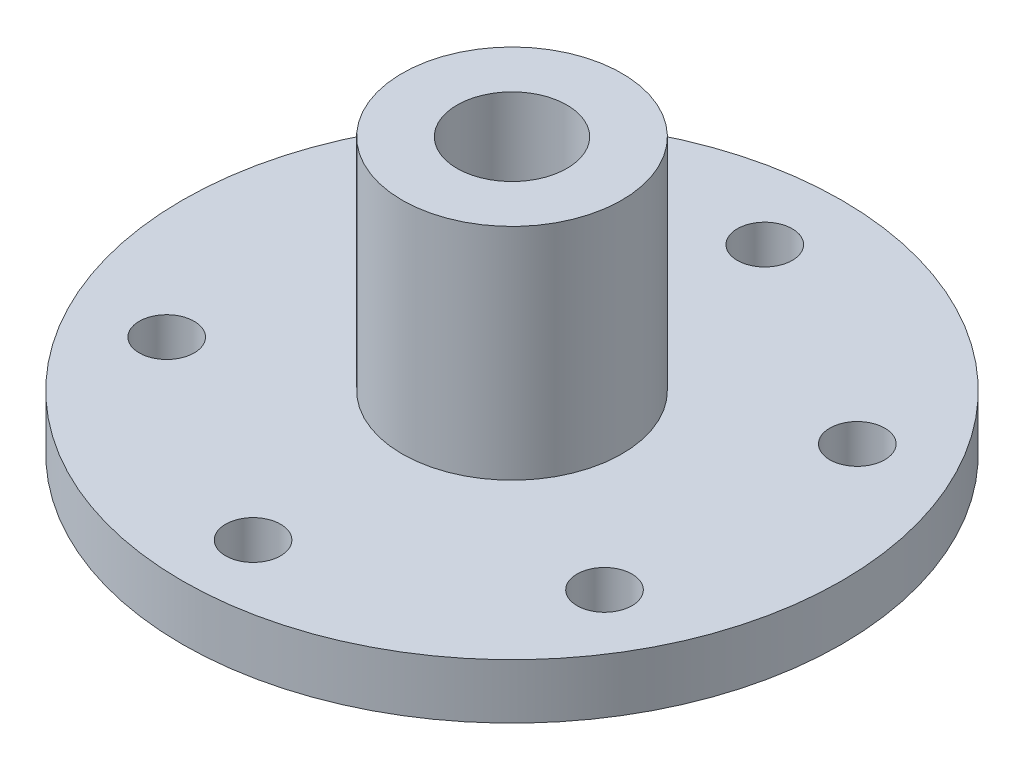
ISO-10303-21;
HEADER;
FILE_DESCRIPTION(('STEP AP214'),'2;1');
FILE_NAME('part.step','',(''),(''),'','','');
FILE_SCHEMA(('AUTOMOTIVE_DESIGN { 1 0 10303 214 1 1 1 1 }'));
ENDSEC;
DATA;
#1=APPLICATION_CONTEXT('core data for automotive mechanical design processes');
#2=APPLICATION_PROTOCOL_DEFINITION('international standard','automotive_design',2000,#1);
#3=PRODUCT_CONTEXT('',#1,'mechanical');
#4=PRODUCT('Part','Part','',(#3));
#5=PRODUCT_RELATED_PRODUCT_CATEGORY('part','',(#4));
#6=PRODUCT_DEFINITION_FORMATION('','',#4);
#7=PRODUCT_DEFINITION_CONTEXT('part definition',#1,'design');
#8=PRODUCT_DEFINITION('design','',#6,#7);
#9=PRODUCT_DEFINITION_SHAPE('','',#8);
#10=(LENGTH_UNIT() NAMED_UNIT(*) SI_UNIT(.MILLI.,.METRE.));
#11=(NAMED_UNIT(*) PLANE_ANGLE_UNIT() SI_UNIT($,.RADIAN.));
#12=(NAMED_UNIT(*) SI_UNIT($,.STERADIAN.) SOLID_ANGLE_UNIT());
#13=UNCERTAINTY_MEASURE_WITH_UNIT(LENGTH_MEASURE(1.E-05),#10,'distance_accuracy_value','');
#14=(GEOMETRIC_REPRESENTATION_CONTEXT(3) GLOBAL_UNCERTAINTY_ASSIGNED_CONTEXT((#13)) GLOBAL_UNIT_ASSIGNED_CONTEXT((#10,
#11,#12)) REPRESENTATION_CONTEXT('',''));
#15=CARTESIAN_POINT('',(0.,0.,0.));
#16=DIRECTION('',(0.,0.,1.));
#17=DIRECTION('',(1.,0.,0.));
#18=AXIS2_PLACEMENT_3D('',#15,#16,#17);
#19=CARTESIAN_POINT('',(0.,5.,0.));
#20=DIRECTION('',(0.,1.,0.));
#21=DIRECTION('',(0.,0.,1.));
#22=AXIS2_PLACEMENT_3D('',#19,#20,#21);
#23=PLANE('',#22);
#24=CARTESIAN_POINT('',(0.,5.,0.));
#25=DIRECTION('',(0.,1.,0.));
#26=DIRECTION('',(0.,0.,1.));
#27=AXIS2_PLACEMENT_3D('',#24,#25,#26);
#28=CIRCLE('',#27,10.);
#29=CARTESIAN_POINT('',(0.,5.,10.));
#30=VERTEX_POINT('',#29);
#31=EDGE_CURVE('E80',#30,#30,#28,.T.);
#32=ORIENTED_EDGE('',*,*,#31,.F.);
#33=EDGE_LOOP('',(#32));
#34=FACE_BOUND('',#33,.T.);
#35=CARTESIAN_POINT('',(-19.9185842870422,5.,11.4999999999998));
#36=DIRECTION('',(0.,1.,0.));
#37=DIRECTION('',(0.,0.,1.));
#38=AXIS2_PLACEMENT_3D('',#35,#36,#37);
#39=CIRCLE('',#38,2.5);
#40=CARTESIAN_POINT('',(-19.9185842870422,5.,13.9999999999998));
#41=VERTEX_POINT('',#40);
#42=EDGE_CURVE('E65',#41,#41,#39,.T.);
#43=ORIENTED_EDGE('',*,*,#42,.F.);
#44=EDGE_LOOP('',(#43));
#45=FACE_BOUND('',#44,.T.);
#46=CARTESIAN_POINT('',(19.918584287042,5.,11.5000000000001));
#47=DIRECTION('',(0.,1.,0.));
#48=DIRECTION('',(0.,0.,1.));
#49=AXIS2_PLACEMENT_3D('',#46,#47,#48);
#50=CIRCLE('',#49,2.5);
#51=CARTESIAN_POINT('',(19.918584287042,5.,14.0000000000001));
#52=VERTEX_POINT('',#51);
#53=EDGE_CURVE('E53',#52,#52,#50,.T.);
#54=ORIENTED_EDGE('',*,*,#53,.F.);
#55=EDGE_LOOP('',(#54));
#56=FACE_BOUND('',#55,.T.);
#57=CARTESIAN_POINT('',(0.,5.,-23.));
#58=DIRECTION('',(0.,1.,0.));
#59=DIRECTION('',(0.,0.,1.));
#60=AXIS2_PLACEMENT_3D('',#57,#58,#59);
#61=CIRCLE('',#60,2.5);
#62=CARTESIAN_POINT('',(0.,5.,-20.5));
#63=VERTEX_POINT('',#62);
#64=EDGE_CURVE('E42',#63,#63,#61,.T.);
#65=ORIENTED_EDGE('',*,*,#64,.F.);
#66=EDGE_LOOP('',(#65));
#67=FACE_BOUND('',#66,.T.);
#68=CARTESIAN_POINT('',(0.,5.,0.));
#69=DIRECTION('',(0.,1.,0.));
#70=DIRECTION('',(0.,0.,1.));
#71=AXIS2_PLACEMENT_3D('',#68,#69,#70);
#72=CIRCLE('',#71,30.);
#73=CARTESIAN_POINT('',(0.,5.,30.));
#74=VERTEX_POINT('',#73);
#75=EDGE_CURVE('E10',#74,#74,#72,.T.);
#76=ORIENTED_EDGE('',*,*,#75,.T.);
#77=EDGE_LOOP('',(#76));
#78=FACE_BOUND('',#77,.T.);
#79=CARTESIAN_POINT('',(19.9185842870421,5.,-11.5));
#80=DIRECTION('',(0.,1.,0.));
#81=DIRECTION('',(0.,0.,1.));
#82=AXIS2_PLACEMENT_3D('',#79,#80,#81);
#83=CIRCLE('',#82,2.5);
#84=CARTESIAN_POINT('',(19.9185842870421,5.,-8.99999999999996));
#85=VERTEX_POINT('',#84);
#86=EDGE_CURVE('E47',#85,#85,#83,.T.);
#87=ORIENTED_EDGE('',*,*,#86,.F.);
#88=EDGE_LOOP('',(#87));
#89=FACE_BOUND('',#88,.T.);
#90=CARTESIAN_POINT('',(-1.67411242882065E-13,5.,23.5610378456656));
#91=DIRECTION('',(0.,1.,0.));
#92=DIRECTION('',(0.,0.,1.));
#93=AXIS2_PLACEMENT_3D('',#90,#91,#92);
#94=CIRCLE('',#93,2.5);
#95=CARTESIAN_POINT('',(-1.67411242882065E-13,5.,26.0610378456656));
#96=VERTEX_POINT('',#95);
#97=EDGE_CURVE('E59',#96,#96,#94,.T.);
#98=ORIENTED_EDGE('',*,*,#97,.F.);
#99=EDGE_LOOP('',(#98));
#100=FACE_BOUND('',#99,.T.);
#101=CARTESIAN_POINT('',(-19.918584287042,5.,-11.5000000000002));
#102=DIRECTION('',(0.,1.,0.));
#103=DIRECTION('',(0.,0.,1.));
#104=AXIS2_PLACEMENT_3D('',#101,#102,#103);
#105=CIRCLE('',#104,2.5);
#106=CARTESIAN_POINT('',(-19.918584287042,5.,-9.00000000000024));
#107=VERTEX_POINT('',#106);
#108=EDGE_CURVE('E71',#107,#107,#105,.T.);
#109=ORIENTED_EDGE('',*,*,#108,.F.);
#110=EDGE_LOOP('',(#109));
#111=FACE_BOUND('',#110,.T.);
#112=ADVANCED_FACE('F31',(#34,#45,#56,#67,#78,#89,#100,#111),#23,.T.);
#113=CARTESIAN_POINT('',(0.,0.,0.));
#114=DIRECTION('',(0.,1.,0.));
#115=DIRECTION('',(0.,0.,1.));
#116=AXIS2_PLACEMENT_3D('',#113,#114,#115);
#117=PLANE('',#116);
#118=CARTESIAN_POINT('',(0.,0.,0.));
#119=DIRECTION('',(0.,1.,0.));
#120=DIRECTION('',(0.,0.,1.));
#121=AXIS2_PLACEMENT_3D('',#118,#119,#120);
#122=CIRCLE('',#121,5.);
#123=CARTESIAN_POINT('',(0.,0.,5.));
#124=VERTEX_POINT('',#123);
#125=EDGE_CURVE('E83',#124,#124,#122,.T.);
#126=ORIENTED_EDGE('',*,*,#125,.T.);
#127=EDGE_LOOP('',(#126));
#128=FACE_BOUND('',#127,.T.);
#129=CARTESIAN_POINT('',(0.,0.,0.));
#130=DIRECTION('',(0.,1.,0.));
#131=DIRECTION('',(0.,0.,1.));
#132=AXIS2_PLACEMENT_3D('',#129,#130,#131);
#133=CIRCLE('',#132,30.);
#134=CARTESIAN_POINT('',(0.,0.,30.));
#135=VERTEX_POINT('',#134);
#136=EDGE_CURVE('E35',#135,#135,#133,.T.);
#137=ORIENTED_EDGE('',*,*,#136,.F.);
#138=EDGE_LOOP('',(#137));
#139=FACE_BOUND('',#138,.T.);
#140=CARTESIAN_POINT('',(0.,0.,-23.));
#141=DIRECTION('',(0.,1.,0.));
#142=DIRECTION('',(0.,0.,1.));
#143=AXIS2_PLACEMENT_3D('',#140,#141,#142);
#144=CIRCLE('',#143,2.5);
#145=CARTESIAN_POINT('',(0.,0.,-20.5));
#146=VERTEX_POINT('',#145);
#147=EDGE_CURVE('E44',#146,#146,#144,.T.);
#148=ORIENTED_EDGE('',*,*,#147,.T.);
#149=EDGE_LOOP('',(#148));
#150=FACE_BOUND('',#149,.T.);
#151=CARTESIAN_POINT('',(19.9185842870421,0.,-11.5));
#152=DIRECTION('',(0.,1.,0.));
#153=DIRECTION('',(0.,0.,1.));
#154=AXIS2_PLACEMENT_3D('',#151,#152,#153);
#155=CIRCLE('',#154,2.5);
#156=CARTESIAN_POINT('',(19.9185842870421,0.,-8.99999999999996));
#157=VERTEX_POINT('',#156);
#158=EDGE_CURVE('E50',#157,#157,#155,.T.);
#159=ORIENTED_EDGE('',*,*,#158,.T.);
#160=EDGE_LOOP('',(#159));
#161=FACE_BOUND('',#160,.T.);
#162=CARTESIAN_POINT('',(19.918584287042,0.,11.5000000000001));
#163=DIRECTION('',(0.,1.,0.));
#164=DIRECTION('',(0.,0.,1.));
#165=AXIS2_PLACEMENT_3D('',#162,#163,#164);
#166=CIRCLE('',#165,2.5);
#167=CARTESIAN_POINT('',(19.918584287042,0.,14.0000000000001));
#168=VERTEX_POINT('',#167);
#169=EDGE_CURVE('E56',#168,#168,#166,.T.);
#170=ORIENTED_EDGE('',*,*,#169,.T.);
#171=EDGE_LOOP('',(#170));
#172=FACE_BOUND('',#171,.T.);
#173=CARTESIAN_POINT('',(-1.67411242882065E-13,0.,23.5610378456656));
#174=DIRECTION('',(0.,1.,0.));
#175=DIRECTION('',(0.,0.,1.));
#176=AXIS2_PLACEMENT_3D('',#173,#174,#175);
#177=CIRCLE('',#176,2.5);
#178=CARTESIAN_POINT('',(-1.67411242882065E-13,0.,26.0610378456656));
#179=VERTEX_POINT('',#178);
#180=EDGE_CURVE('E62',#179,#179,#177,.T.);
#181=ORIENTED_EDGE('',*,*,#180,.T.);
#182=EDGE_LOOP('',(#181));
#183=FACE_BOUND('',#182,.T.);
#184=CARTESIAN_POINT('',(-19.9185842870422,0.,11.4999999999998));
#185=DIRECTION('',(0.,1.,0.));
#186=DIRECTION('',(0.,0.,1.));
#187=AXIS2_PLACEMENT_3D('',#184,#185,#186);
#188=CIRCLE('',#187,2.5);
#189=CARTESIAN_POINT('',(-19.9185842870422,0.,13.9999999999998));
#190=VERTEX_POINT('',#189);
#191=EDGE_CURVE('E68',#190,#190,#188,.T.);
#192=ORIENTED_EDGE('',*,*,#191,.T.);
#193=EDGE_LOOP('',(#192));
#194=FACE_BOUND('',#193,.T.);
#195=CARTESIAN_POINT('',(-19.918584287042,0.,-11.5000000000002));
#196=DIRECTION('',(0.,1.,0.));
#197=DIRECTION('',(0.,0.,1.));
#198=AXIS2_PLACEMENT_3D('',#195,#196,#197);
#199=CIRCLE('',#198,2.5);
#200=CARTESIAN_POINT('',(-19.918584287042,0.,-9.00000000000024));
#201=VERTEX_POINT('',#200);
#202=EDGE_CURVE('E74',#201,#201,#199,.T.);
#203=ORIENTED_EDGE('',*,*,#202,.T.);
#204=EDGE_LOOP('',(#203));
#205=FACE_BOUND('',#204,.T.);
#206=ADVANCED_FACE('F110',(#128,#139,#150,#161,#172,#183,#194,#205),#117,.F.);
#207=CARTESIAN_POINT('',(0.,5.,0.));
#208=DIRECTION('',(0.,-1.,0.));
#209=DIRECTION('',(0.,0.,-1.));
#210=AXIS2_PLACEMENT_3D('',#207,#208,#209);
#211=CYLINDRICAL_SURFACE('',#210,30.);
#212=ORIENTED_EDGE('',*,*,#75,.F.);
#213=EDGE_LOOP('',(#212));
#214=FACE_BOUND('',#213,.T.);
#215=ORIENTED_EDGE('',*,*,#136,.T.);
#216=EDGE_LOOP('',(#215));
#217=FACE_BOUND('',#216,.T.);
#218=ADVANCED_FACE('F33',(#214,#217),#211,.T.);
#219=CARTESIAN_POINT('',(0.,5.,-23.));
#220=DIRECTION('',(0.,-1.,0.));
#221=DIRECTION('',(0.,0.,-1.));
#222=AXIS2_PLACEMENT_3D('',#219,#220,#221);
#223=CYLINDRICAL_SURFACE('',#222,2.5);
#224=ORIENTED_EDGE('',*,*,#64,.T.);
#225=EDGE_LOOP('',(#224));
#226=FACE_BOUND('',#225,.T.);
#227=ORIENTED_EDGE('',*,*,#147,.F.);
#228=EDGE_LOOP('',(#227));
#229=FACE_BOUND('',#228,.T.);
#230=ADVANCED_FACE('F135',(#226,#229),#223,.F.);
#231=CARTESIAN_POINT('',(19.9185842870421,5.,-11.5));
#232=DIRECTION('',(0.,-1.,0.));
#233=DIRECTION('',(0.,0.,-1.));
#234=AXIS2_PLACEMENT_3D('',#231,#232,#233);
#235=CYLINDRICAL_SURFACE('',#234,2.5);
#236=ORIENTED_EDGE('',*,*,#86,.T.);
#237=EDGE_LOOP('',(#236));
#238=FACE_BOUND('',#237,.T.);
#239=ORIENTED_EDGE('',*,*,#158,.F.);
#240=EDGE_LOOP('',(#239));
#241=FACE_BOUND('',#240,.T.);
#242=ADVANCED_FACE('F141',(#238,#241),#235,.F.);
#243=CARTESIAN_POINT('',(19.918584287042,5.,11.5000000000001));
#244=DIRECTION('',(0.,-1.,0.));
#245=DIRECTION('',(0.,0.,-1.));
#246=AXIS2_PLACEMENT_3D('',#243,#244,#245);
#247=CYLINDRICAL_SURFACE('',#246,2.5);
#248=ORIENTED_EDGE('',*,*,#53,.T.);
#249=EDGE_LOOP('',(#248));
#250=FACE_BOUND('',#249,.T.);
#251=ORIENTED_EDGE('',*,*,#169,.F.);
#252=EDGE_LOOP('',(#251));
#253=FACE_BOUND('',#252,.T.);
#254=ADVANCED_FACE('F145',(#250,#253),#247,.F.);
#255=CARTESIAN_POINT('',(-1.67411242882065E-13,5.,23.5610378456656));
#256=DIRECTION('',(0.,-1.,0.));
#257=DIRECTION('',(0.,0.,-1.));
#258=AXIS2_PLACEMENT_3D('',#255,#256,#257);
#259=CYLINDRICAL_SURFACE('',#258,2.5);
#260=ORIENTED_EDGE('',*,*,#97,.T.);
#261=EDGE_LOOP('',(#260));
#262=FACE_BOUND('',#261,.T.);
#263=ORIENTED_EDGE('',*,*,#180,.F.);
#264=EDGE_LOOP('',(#263));
#265=FACE_BOUND('',#264,.T.);
#266=ADVANCED_FACE('F149',(#262,#265),#259,.F.);
#267=CARTESIAN_POINT('',(-19.9185842870422,5.,11.4999999999998));
#268=DIRECTION('',(0.,-1.,0.));
#269=DIRECTION('',(0.,0.,-1.));
#270=AXIS2_PLACEMENT_3D('',#267,#268,#269);
#271=CYLINDRICAL_SURFACE('',#270,2.5);
#272=ORIENTED_EDGE('',*,*,#42,.T.);
#273=EDGE_LOOP('',(#272));
#274=FACE_BOUND('',#273,.T.);
#275=ORIENTED_EDGE('',*,*,#191,.F.);
#276=EDGE_LOOP('',(#275));
#277=FACE_BOUND('',#276,.T.);
#278=ADVANCED_FACE('F126',(#274,#277),#271,.F.);
#279=CARTESIAN_POINT('',(-19.918584287042,5.,-11.5000000000002));
#280=DIRECTION('',(0.,-1.,0.));
#281=DIRECTION('',(0.,0.,-1.));
#282=AXIS2_PLACEMENT_3D('',#279,#280,#281);
#283=CYLINDRICAL_SURFACE('',#282,2.5);
#284=ORIENTED_EDGE('',*,*,#108,.T.);
#285=EDGE_LOOP('',(#284));
#286=FACE_BOUND('',#285,.T.);
#287=ORIENTED_EDGE('',*,*,#202,.F.);
#288=EDGE_LOOP('',(#287));
#289=FACE_BOUND('',#288,.T.);
#290=ADVANCED_FACE('F104',(#286,#289),#283,.F.);
#291=CARTESIAN_POINT('',(0.,25.,0.));
#292=DIRECTION('',(0.,-1.,0.));
#293=DIRECTION('',(0.,0.,-1.));
#294=AXIS2_PLACEMENT_3D('',#291,#292,#293);
#295=CYLINDRICAL_SURFACE('',#294,10.);
#296=CARTESIAN_POINT('',(0.,25.,0.));
#297=DIRECTION('',(0.,1.,0.));
#298=DIRECTION('',(0.,0.,1.));
#299=AXIS2_PLACEMENT_3D('',#296,#297,#298);
#300=CIRCLE('',#299,10.);
#301=CARTESIAN_POINT('',(0.,25.,10.));
#302=VERTEX_POINT('',#301);
#303=EDGE_CURVE('E77',#302,#302,#300,.T.);
#304=ORIENTED_EDGE('',*,*,#303,.F.);
#305=EDGE_LOOP('',(#304));
#306=FACE_BOUND('',#305,.T.);
#307=ORIENTED_EDGE('',*,*,#31,.T.);
#308=EDGE_LOOP('',(#307));
#309=FACE_BOUND('',#308,.T.);
#310=ADVANCED_FACE('F98',(#306,#309),#295,.T.);
#311=CARTESIAN_POINT('',(0.,25.,0.));
#312=DIRECTION('',(0.,1.,0.));
#313=DIRECTION('',(0.,0.,1.));
#314=AXIS2_PLACEMENT_3D('',#311,#312,#313);
#315=PLANE('',#314);
#316=CARTESIAN_POINT('',(0.,25.,0.));
#317=DIRECTION('',(0.,1.,0.));
#318=DIRECTION('',(0.,0.,1.));
#319=AXIS2_PLACEMENT_3D('',#316,#317,#318);
#320=CIRCLE('',#319,5.);
#321=CARTESIAN_POINT('',(0.,25.,5.));
#322=VERTEX_POINT('',#321);
#323=EDGE_CURVE('E88',#322,#322,#320,.T.);
#324=ORIENTED_EDGE('',*,*,#323,.F.);
#325=EDGE_LOOP('',(#324));
#326=FACE_BOUND('',#325,.T.);
#327=ORIENTED_EDGE('',*,*,#303,.T.);
#328=EDGE_LOOP('',(#327));
#329=FACE_BOUND('',#328,.T.);
#330=ADVANCED_FACE('F95',(#326,#329),#315,.T.);
#331=CARTESIAN_POINT('',(0.,-20.,0.));
#332=DIRECTION('',(0.,1.,0.));
#333=DIRECTION('',(0.,0.,1.));
#334=AXIS2_PLACEMENT_3D('',#331,#332,#333);
#335=CYLINDRICAL_SURFACE('',#334,5.);
#336=ORIENTED_EDGE('',*,*,#323,.T.);
#337=EDGE_LOOP('',(#336));
#338=FACE_BOUND('',#337,.T.);
#339=ORIENTED_EDGE('',*,*,#125,.F.);
#340=EDGE_LOOP('',(#339));
#341=FACE_BOUND('',#340,.T.);
#342=ADVANCED_FACE('F92',(#338,#341),#335,.F.);
#343=CLOSED_SHELL('',(#112,#206,#218,#230,#242,#254,#266,#278,#290,#310,#330,#342));
#344=MANIFOLD_SOLID_BREP('B2',#343);
#345=ADVANCED_BREP_SHAPE_REPRESENTATION('',(#18,#344),#14);
#346=SHAPE_DEFINITION_REPRESENTATION(#9,#345);
ENDSEC;
END-ISO-10303-21;
